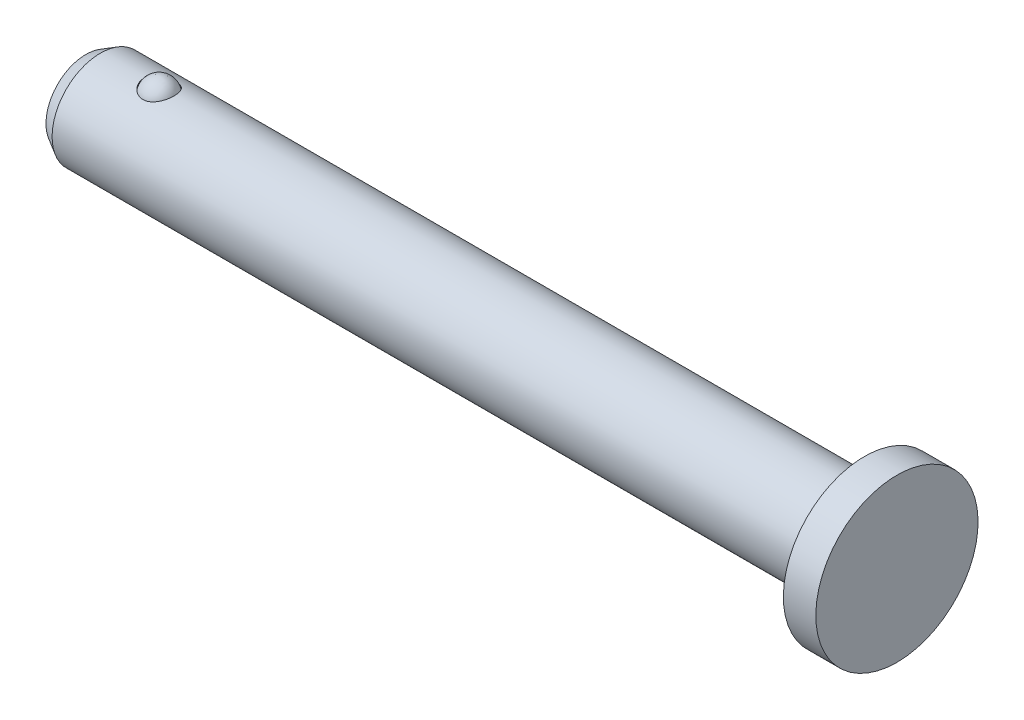
ISO-10303-21;
HEADER;
FILE_DESCRIPTION(('STEP AP214'),'2;1');
FILE_NAME('part.step','',(''),(''),'','','');
FILE_SCHEMA(('AUTOMOTIVE_DESIGN { 1 0 10303 214 1 1 1 1 }'));
ENDSEC;
DATA;
#1=APPLICATION_CONTEXT('core data for automotive mechanical design processes');
#2=APPLICATION_PROTOCOL_DEFINITION('international standard','automotive_design',2000,#1);
#3=PRODUCT_CONTEXT('',#1,'mechanical');
#4=PRODUCT('Part','Part','',(#3));
#5=PRODUCT_RELATED_PRODUCT_CATEGORY('part','',(#4));
#6=PRODUCT_DEFINITION_FORMATION('','',#4);
#7=PRODUCT_DEFINITION_CONTEXT('part definition',#1,'design');
#8=PRODUCT_DEFINITION('design','',#6,#7);
#9=PRODUCT_DEFINITION_SHAPE('','',#8);
#10=(LENGTH_UNIT() NAMED_UNIT(*) SI_UNIT(.MILLI.,.METRE.));
#11=(NAMED_UNIT(*) PLANE_ANGLE_UNIT() SI_UNIT($,.RADIAN.));
#12=(NAMED_UNIT(*) SI_UNIT($,.STERADIAN.) SOLID_ANGLE_UNIT());
#13=UNCERTAINTY_MEASURE_WITH_UNIT(LENGTH_MEASURE(1.E-05),#10,'distance_accuracy_value','');
#14=(GEOMETRIC_REPRESENTATION_CONTEXT(3) GLOBAL_UNCERTAINTY_ASSIGNED_CONTEXT((#13)) GLOBAL_UNIT_ASSIGNED_CONTEXT((#10,
#11,#12)) REPRESENTATION_CONTEXT('',''));
#15=CARTESIAN_POINT('',(0.,0.,0.));
#16=DIRECTION('',(0.,0.,1.));
#17=DIRECTION('',(1.,0.,0.));
#18=AXIS2_PLACEMENT_3D('',#15,#16,#17);
#19=CARTESIAN_POINT('',(-16.26235,2.02985730626251,0.));
#20=DIRECTION('',(-1.,0.,0.));
#21=DIRECTION('',(0.,1.,0.));
#22=AXIS2_PLACEMENT_3D('',#19,#20,#21);
#23=SPHERICAL_SURFACE('',#22,0.789542693737488);
#24=CARTESIAN_POINT('',(-17.0518926937375,2.02985730626251,0.));
#25=VERTEX_POINT('',#24);
#26=VERTEX_LOOP('',#25);
#27=FACE_BOUND('',#26,.T.);
#28=ADVANCED_FACE('F43',(#27),#23,.T.);
#29=CLOSED_SHELL('',(#28));
#30=MANIFOLD_SOLID_BREP('B2',#29);
#31=CARTESIAN_POINT('',(-19.84375,0.,0.));
#32=DIRECTION('',(-1.,0.,0.));
#33=DIRECTION('',(0.,-1.,0.));
#34=AXIS2_PLACEMENT_3D('',#31,#32,#33);
#35=CYLINDRICAL_SURFACE('',#34,2.3622);
#36=CARTESIAN_POINT('',(-19.13509,0.,0.));
#37=DIRECTION('',(-1.,0.,0.));
#38=DIRECTION('',(0.,-1.,0.));
#39=AXIS2_PLACEMENT_3D('',#36,#37,#38);
#40=CIRCLE('',#39,2.3622);
#41=CARTESIAN_POINT('',(-19.13509,-2.3622,0.));
#42=VERTEX_POINT('',#41);
#43=EDGE_CURVE('E67',#42,#42,#40,.T.);
#44=ORIENTED_EDGE('',*,*,#43,.F.);
#45=EDGE_LOOP('',(#44));
#46=FACE_BOUND('',#45,.T.);
#47=CARTESIAN_POINT('',(18.25625,0.,0.));
#48=DIRECTION('',(-1.,0.,0.));
#49=DIRECTION('',(0.,-1.,0.));
#50=AXIS2_PLACEMENT_3D('',#47,#48,#49);
#51=CIRCLE('',#50,2.3622);
#52=CARTESIAN_POINT('',(18.25625,-2.3622,0.));
#53=VERTEX_POINT('',#52);
#54=EDGE_CURVE('E42',#53,#53,#51,.T.);
#55=ORIENTED_EDGE('',*,*,#54,.T.);
#56=EDGE_LOOP('',(#55));
#57=FACE_BOUND('',#56,.T.);
#58=CARTESIAN_POINT('',(-16.26235,2.22581604673215,-0.791032089178223));
#59=CARTESIAN_POINT('',(-16.3018338222643,2.22581576398311,-0.791032519638611));
#60=CARTESIAN_POINT('',(-16.3413151384197,2.22697971671572,-0.787780239460781));
#61=CARTESIAN_POINT('',(-16.4190911852111,2.23149491079169,-0.774896744356571));
#62=CARTESIAN_POINT('',(-16.4573858392533,2.2348462930174,-0.765265118565097));
#63=CARTESIAN_POINT('',(-16.531633713184,2.24333848583653,-0.739997800068514));
#64=CARTESIAN_POINT('',(-16.5675913296129,2.24847581373636,-0.724373786774371));
#65=CARTESIAN_POINT('',(-16.6363604141592,2.25998083212617,-0.687636848342251));
#66=CARTESIAN_POINT('',(-16.6691713829049,2.26634871742328,-0.666523053944659));
#67=CARTESIAN_POINT('',(-16.7319315200548,2.27988127975237,-0.618680689218364));
#68=CARTESIAN_POINT('',(-16.7617565640189,2.28706485050395,-0.591794972427997));
#69=CARTESIAN_POINT('',(-16.8167458077474,2.30133787147743,-0.533600878356361));
#70=CARTESIAN_POINT('',(-16.8419088865026,2.30842729868224,-0.502291440535601));
#71=CARTESIAN_POINT('',(-16.88866080437,2.32229610981989,-0.433849997368858));
#72=CARTESIAN_POINT('',(-16.9099016466427,2.32902369976236,-0.396469482014573));
#73=CARTESIAN_POINT('',(-16.9462545129409,2.34094584755715,-0.318610784362622));
#74=CARTESIAN_POINT('',(-16.9613651181152,2.34614005042941,-0.278131887514646));
#75=CARTESIAN_POINT('',(-16.9857004779035,2.35466270542611,-0.193473280151713));
#76=CARTESIAN_POINT('',(-16.9946653937695,2.35790814356074,-0.149210288520306));
#77=CARTESIAN_POINT('',(-17.005565894284,2.36186996349137,-0.0597154884593794));
#78=CARTESIAN_POINT('',(-17.0075008699652,2.36258612618922,-0.0144835964404185));
#79=CARTESIAN_POINT('',(-17.0042909971991,2.36141021290238,0.0762430533264951));
#80=CARTESIAN_POINT('',(-16.9990605263757,2.35948659277288,0.121734407393892));
#81=CARTESIAN_POINT('',(-16.9814508372294,2.35317206611294,0.211137527329617));
#82=CARTESIAN_POINT('',(-16.9690713024393,2.34878105035866,0.255049223179882));
#83=CARTESIAN_POINT('',(-16.9373785333382,2.33799474034002,0.340003755419018));
#84=CARTESIAN_POINT('',(-16.9180697195014,2.33160072420233,0.381048400920879));
#85=CARTESIAN_POINT('',(-16.8728542738949,2.31749884585933,0.45908762846867));
#86=CARTESIAN_POINT('',(-16.8469476298871,2.30979098121703,0.49608220300213));
#87=CARTESIAN_POINT('',(-16.7895191404422,2.2940716483114,0.564297213422602));
#88=CARTESIAN_POINT('',(-16.7580957761656,2.28606718272386,0.595601988346434));
#89=CARTESIAN_POINT('',(-16.6900563583582,2.27059247122217,0.652119197807015));
#90=CARTESIAN_POINT('',(-16.6534418764304,2.26312206464838,0.677333470010342));
#91=CARTESIAN_POINT('',(-16.5779492741709,2.25001785060625,0.71963628712746));
#92=CARTESIAN_POINT('',(-16.5392775456061,2.24431058256401,0.737069660996988));
#93=CARTESIAN_POINT('',(-16.4592512672778,2.23497292980211,0.764920542936362));
#94=CARTESIAN_POINT('',(-16.4178981594483,2.23134143896186,0.775341788088755));
#95=CARTESIAN_POINT('',(-16.336791790642,2.22680429519513,0.788273335332939));
#96=CARTESIAN_POINT('',(-16.2971273529941,2.2257265947787,0.791283526133024));
#97=CARTESIAN_POINT('',(-16.2178529464748,2.2259171339851,0.790747912230158));
#98=CARTESIAN_POINT('',(-16.1782429675224,2.227184856437,0.787203552820129));
#99=CARTESIAN_POINT('',(-16.101593807461,2.23183155461559,0.773926866318529));
#100=CARTESIAN_POINT('',(-16.0645129744794,2.23513795566731,0.764407057193664));
#101=CARTESIAN_POINT('',(-15.9924941222932,2.24343404277332,0.739703383423264));
#102=CARTESIAN_POINT('',(-15.9575563106065,2.24842389153994,0.724518971254892));
#103=CARTESIAN_POINT('',(-15.8896511257475,2.25973866548061,0.688430400089751));
#104=CARTESIAN_POINT('',(-15.8567728995766,2.26609879126542,0.667369988967335));
#105=CARTESIAN_POINT('',(-15.7948539005421,2.27941389290418,0.620368260180016));
#106=CARTESIAN_POINT('',(-15.7658141812176,2.28636903120949,0.594425607222326));
#107=CARTESIAN_POINT('',(-15.7103363875522,2.30067315029258,0.53650441012868));
#108=CARTESIAN_POINT('',(-15.6841940827522,2.30801802589022,0.504241497413388));
#109=CARTESIAN_POINT('',(-15.6373294223548,2.3219066096982,0.435840003810781));
#110=CARTESIAN_POINT('',(-15.6166085654881,2.32845009610334,0.399700355105055));
#111=CARTESIAN_POINT('',(-15.5799154074514,2.34044485511105,0.32236581590907));
#112=CARTESIAN_POINT('',(-15.5642733166028,2.34581462134006,0.281001264451537));
#113=CARTESIAN_POINT('',(-15.5396525932013,2.35443088539652,0.19612297154861));
#114=CARTESIAN_POINT('',(-15.5306749478103,2.35767706866266,0.152608912728052));
#115=CARTESIAN_POINT('',(-15.5193857562819,2.36177692867522,0.0635170638966755));
#116=CARTESIAN_POINT('',(-15.5172440137684,2.36256964717617,0.017914843369445));
#117=CARTESIAN_POINT('',(-15.520139881845,2.3615088375365,-0.0730313594257119));
#118=CARTESIAN_POINT('',(-15.5251778997728,2.35965515925471,-0.118375326895324));
#119=CARTESIAN_POINT('',(-15.5423917858139,2.35347668943244,-0.20772830543412));
#120=CARTESIAN_POINT('',(-15.5545996260354,2.34914083140647,-0.251730402335729));
#121=CARTESIAN_POINT('',(-15.5859777734291,2.33844323829137,-0.33692140450069));
#122=CARTESIAN_POINT('',(-15.6051483348,2.33208142923882,-0.378110206989595));
#123=CARTESIAN_POINT('',(-15.6499743354645,2.31806542607961,-0.45620965136972));
#124=CARTESIAN_POINT('',(-15.6755888264204,2.31041949036449,-0.49314523746102));
#125=CARTESIAN_POINT('',(-15.7328670809521,2.29467177360045,-0.561885478042449));
#126=CARTESIAN_POINT('',(-15.7645302727704,2.28657003568757,-0.593690616967873));
#127=CARTESIAN_POINT('',(-15.8321103675284,2.27114006586694,-0.65018826947417));
#128=CARTESIAN_POINT('',(-15.8678630627565,2.26379555842983,-0.675072287191635));
#129=CARTESIAN_POINT('',(-15.9434509291089,2.25051576769323,-0.718107031490447));
#130=CARTESIAN_POINT('',(-15.9832838483709,2.24457971300892,-0.736261446834665));
#131=CARTESIAN_POINT('',(-16.0625351985796,2.23529527948482,-0.763964093369265));
#132=CARTESIAN_POINT('',(-16.1017351816544,2.2317787962283,-0.774081433169419));
#133=CARTESIAN_POINT('',(-16.1814079558051,2.22703972798425,-0.787614032349746));
#134=CARTESIAN_POINT('',(-16.221880294314,2.22581633654123,-0.791031647969541));
#135=CARTESIAN_POINT('',(-16.26235,2.22581604673215,-0.791032089178223));
#136=B_SPLINE_CURVE_WITH_KNOTS('',3,(#58,#59,#60,#61,#62,#63,#64,#65,#66,#67,#68,#69,#70,#71,
#72,#73,#74,#75,#76,#77,#78,#79,#80,#81,#82,#83,#84,#85,#86,#87,#88,#89,#90,#91,#92,#93,#94,#95,
#96,#97,#98,#99,#100,#101,#102,#103,#104,#105,#106,#107,#108,#109,#110,#111,#112,#113,#114,#115,
#116,#117,#118,#119,#120,#121,#122,#123,#124,#125,#126,#127,#128,#129,#130,#131,#132,#133,#134,
#135),.UNSPECIFIED.,.T.,.F.,(4,2,2,2,2,2,2,2,2,2,2,2,2,2,2,2,2,2,2,2,2,2,2,2,2,2,2,2,2,2,2,2,2,
2,2,2,2,2,4),(0.,0.118299361509042,0.23660634289136,0.354683901324836,0.472780167721935,
0.594630449676355,0.71650999364796,0.846477480289193,0.976475030932804,1.1116766565592,
1.24688999372125,1.38373321192028,1.52058248821508,1.65734461742628,1.79410700031297,
1.92863866932186,2.06312969570308,2.19085824756083,2.31851867302865,2.43729849240827,
2.55605212369601,2.6708045306772,2.78556803214263,2.90373452362426,3.02193338072497,
3.14788853933123,3.27387848087818,3.40691156896659,3.53996435847092,3.67629744685247,
3.81263827028837,3.94959173936421,4.08655020891101,4.22265943045033,4.35875579253439,
4.49059132495187,4.62235448583304,4.74365036609798,4.86490357990958),.UNSPECIFIED.);
#137=CARTESIAN_POINT('',(-16.26235,2.22581604673215,-0.791032089178223));
#138=VERTEX_POINT('',#137);
#139=EDGE_CURVE('E59',#138,#138,#136,.T.);
#140=ORIENTED_EDGE('',*,*,#139,.F.);
#141=EDGE_LOOP('',(#140));
#142=FACE_BOUND('',#141,.T.);
#143=ADVANCED_FACE('F55',(#46,#57,#142),#35,.T.);
#144=CARTESIAN_POINT('',(18.25625,2.3622,0.));
#145=DIRECTION('',(1.,0.,0.));
#146=DIRECTION('',(0.,1.,0.));
#147=AXIS2_PLACEMENT_3D('',#144,#145,#146);
#148=PLANE('',#147);
#149=ORIENTED_EDGE('',*,*,#54,.F.);
#150=EDGE_LOOP('',(#149));
#151=FACE_BOUND('',#150,.T.);
#152=CARTESIAN_POINT('',(18.25625,0.,0.));
#153=DIRECTION('',(-1.,0.,0.));
#154=DIRECTION('',(0.,-1.,0.));
#155=AXIS2_PLACEMENT_3D('',#152,#153,#154);
#156=CIRCLE('',#155,3.96874999999999);
#157=CARTESIAN_POINT('',(18.25625,-3.96874999999999,0.));
#158=VERTEX_POINT('',#157);
#159=EDGE_CURVE('E79',#158,#158,#156,.T.);
#160=ORIENTED_EDGE('',*,*,#159,.T.);
#161=EDGE_LOOP('',(#160));
#162=FACE_BOUND('',#161,.T.);
#163=ADVANCED_FACE('F57',(#151,#162),#148,.F.);
#164=CARTESIAN_POINT('',(-19.13509,0.,0.));
#165=DIRECTION('',(1.,0.,0.));
#166=DIRECTION('',(0.,1.,0.));
#167=AXIS2_PLACEMENT_3D('',#164,#165,#166);
#168=CONICAL_SURFACE('',#167,2.3622,0.523598775598301);
#169=CARTESIAN_POINT('',(-19.84375,0.,0.));
#170=DIRECTION('',(-1.,0.,0.));
#171=DIRECTION('',(0.,-1.,0.));
#172=AXIS2_PLACEMENT_3D('',#169,#170,#171);
#173=CIRCLE('',#172,1.95305495823607);
#174=CARTESIAN_POINT('',(-19.84375,-1.95305495823607,0.));
#175=VERTEX_POINT('',#174);
#176=EDGE_CURVE('E71',#175,#175,#173,.T.);
#177=ORIENTED_EDGE('',*,*,#176,.F.);
#178=EDGE_LOOP('',(#177));
#179=FACE_BOUND('',#178,.T.);
#180=ORIENTED_EDGE('',*,*,#43,.T.);
#181=EDGE_LOOP('',(#180));
#182=FACE_BOUND('',#181,.T.);
#183=ADVANCED_FACE('F93',(#179,#182),#168,.T.);
#184=CARTESIAN_POINT('',(-19.84375,1.95305495823607,0.));
#185=DIRECTION('',(1.,0.,0.));
#186=DIRECTION('',(0.,1.,0.));
#187=AXIS2_PLACEMENT_3D('',#184,#185,#186);
#188=PLANE('',#187);
#189=ORIENTED_EDGE('',*,*,#176,.T.);
#190=EDGE_LOOP('',(#189));
#191=FACE_BOUND('',#190,.T.);
#192=ADVANCED_FACE('F100',(#191),#188,.F.);
#193=CARTESIAN_POINT('',(19.84375,3.96874999999999,0.));
#194=DIRECTION('',(-1.,0.,0.));
#195=DIRECTION('',(0.,-1.,0.));
#196=AXIS2_PLACEMENT_3D('',#193,#194,#195);
#197=PLANE('',#196);
#198=CARTESIAN_POINT('',(19.84375,0.,0.));
#199=DIRECTION('',(-1.,0.,0.));
#200=DIRECTION('',(0.,-1.,0.));
#201=AXIS2_PLACEMENT_3D('',#198,#199,#200);
#202=CIRCLE('',#201,3.96874999999999);
#203=CARTESIAN_POINT('',(19.84375,-3.96874999999999,0.));
#204=VERTEX_POINT('',#203);
#205=EDGE_CURVE('E76',#204,#204,#202,.T.);
#206=ORIENTED_EDGE('',*,*,#205,.F.);
#207=EDGE_LOOP('',(#206));
#208=FACE_BOUND('',#207,.T.);
#209=ADVANCED_FACE('F104',(#208),#197,.F.);
#210=CARTESIAN_POINT('',(-19.84375,0.,0.));
#211=DIRECTION('',(-1.,0.,0.));
#212=DIRECTION('',(0.,-1.,0.));
#213=AXIS2_PLACEMENT_3D('',#210,#211,#212);
#214=CYLINDRICAL_SURFACE('',#213,3.96874999999999);
#215=ORIENTED_EDGE('',*,*,#159,.F.);
#216=EDGE_LOOP('',(#215));
#217=FACE_BOUND('',#216,.T.);
#218=ORIENTED_EDGE('',*,*,#205,.T.);
#219=EDGE_LOOP('',(#218));
#220=FACE_BOUND('',#219,.T.);
#221=ADVANCED_FACE('F108',(#217,#220),#214,.T.);
#222=CARTESIAN_POINT('',(-16.26235,2.02985730626251,0.));
#223=DIRECTION('',(-1.,0.,0.));
#224=DIRECTION('',(0.,1.,0.));
#225=AXIS2_PLACEMENT_3D('',#222,#223,#224);
#226=SPHERICAL_SURFACE('',#225,0.814942693737488);
#227=ORIENTED_EDGE('',*,*,#139,.T.);
#228=EDGE_LOOP('',(#227));
#229=FACE_BOUND('',#228,.T.);
#230=ADVANCED_FACE('F86',(#229),#226,.F.);
#231=CLOSED_SHELL('',(#143,#163,#183,#192,#209,#221,#230));
#232=MANIFOLD_SOLID_BREP('B6',#231);
#233=ADVANCED_BREP_SHAPE_REPRESENTATION('',(#18,#30,#232),#14);
#234=SHAPE_DEFINITION_REPRESENTATION(#9,#233);
ENDSEC;
END-ISO-10303-21;
